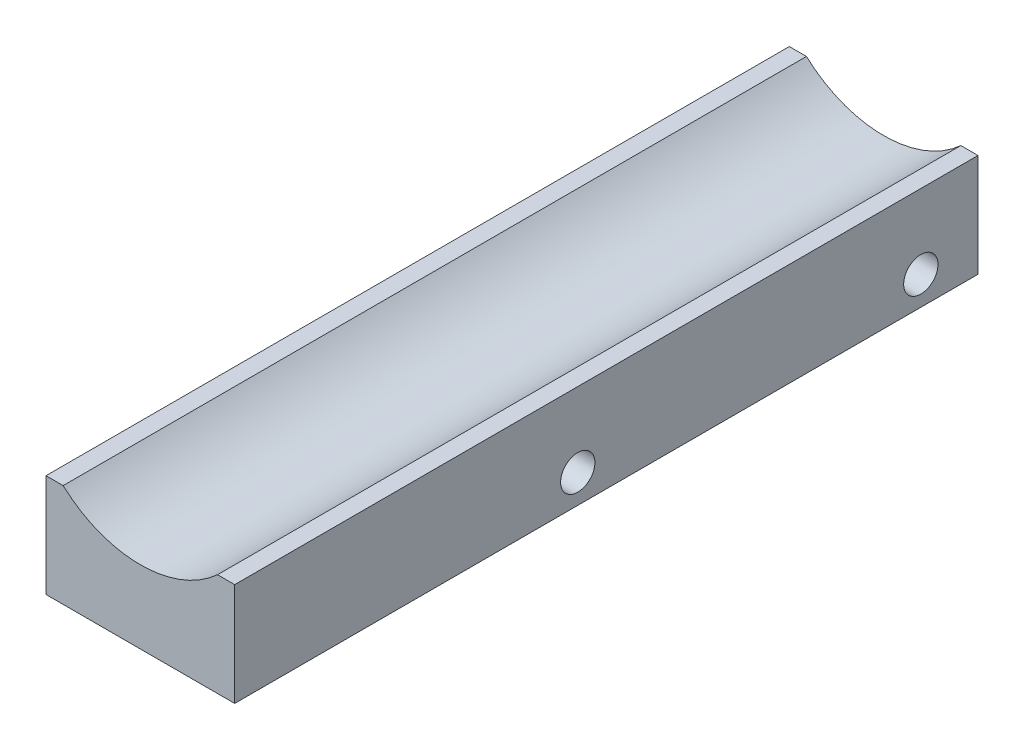
ISO-10303-21;
HEADER;
FILE_DESCRIPTION(('STEP AP214'),'2;1');
FILE_NAME('part.step','',(''),(''),'','','');
FILE_SCHEMA(('AUTOMOTIVE_DESIGN { 1 0 10303 214 1 1 1 1 }'));
ENDSEC;
DATA;
#1=APPLICATION_CONTEXT('core data for automotive mechanical design processes');
#2=APPLICATION_PROTOCOL_DEFINITION('international standard','automotive_design',2000,#1);
#3=PRODUCT_CONTEXT('',#1,'mechanical');
#4=PRODUCT('Part','Part','',(#3));
#5=PRODUCT_RELATED_PRODUCT_CATEGORY('part','',(#4));
#6=PRODUCT_DEFINITION_FORMATION('','',#4);
#7=PRODUCT_DEFINITION_CONTEXT('part definition',#1,'design');
#8=PRODUCT_DEFINITION('design','',#6,#7);
#9=PRODUCT_DEFINITION_SHAPE('','',#8);
#10=(LENGTH_UNIT() NAMED_UNIT(*) SI_UNIT(.MILLI.,.METRE.));
#11=(NAMED_UNIT(*) PLANE_ANGLE_UNIT() SI_UNIT($,.RADIAN.));
#12=(NAMED_UNIT(*) SI_UNIT($,.STERADIAN.) SOLID_ANGLE_UNIT());
#13=UNCERTAINTY_MEASURE_WITH_UNIT(LENGTH_MEASURE(1.E-05),#10,'distance_accuracy_value','');
#14=(GEOMETRIC_REPRESENTATION_CONTEXT(3) GLOBAL_UNCERTAINTY_ASSIGNED_CONTEXT((#13)) GLOBAL_UNIT_ASSIGNED_CONTEXT((#10,
#11,#12)) REPRESENTATION_CONTEXT('',''));
#15=CARTESIAN_POINT('',(0.,0.,0.));
#16=DIRECTION('',(0.,0.,1.));
#17=DIRECTION('',(1.,0.,0.));
#18=AXIS2_PLACEMENT_3D('',#15,#16,#17);
#19=CARTESIAN_POINT('',(-13.5,-5.,60.));
#20=DIRECTION('',(0.,0.,-1.));
#21=DIRECTION('',(1.,0.,0.));
#22=AXIS2_PLACEMENT_3D('',#19,#20,#21);
#23=PLANE('',#22);
#24=DIRECTION('',(-1.,0.,0.));
#25=VECTOR('',#24,1.);
#26=CARTESIAN_POINT('',(13.5,13.,60.));
#27=LINE('',#26,#25);
#28=CARTESIAN_POINT('',(16.5,13.,60.));
#29=VERTEX_POINT('',#28);
#30=CARTESIAN_POINT('',(13.5,13.,60.));
#31=VERTEX_POINT('',#30);
#32=EDGE_CURVE('E49',#29,#31,#27,.T.);
#33=ORIENTED_EDGE('',*,*,#32,.T.);
#34=CARTESIAN_POINT('',(0.,27.7563545633736,60.));
#35=DIRECTION('',(0.,0.,-1.));
#36=DIRECTION('',(1.,0.,0.));
#37=AXIS2_PLACEMENT_3D('',#34,#35,#36);
#38=CIRCLE('',#37,19.9999999999999);
#39=CARTESIAN_POINT('',(-13.5,13.,60.));
#40=VERTEX_POINT('',#39);
#41=EDGE_CURVE('E93',#31,#40,#38,.T.);
#42=ORIENTED_EDGE('',*,*,#41,.T.);
#43=DIRECTION('',(-1.,0.,0.));
#44=VECTOR('',#43,1.);
#45=CARTESIAN_POINT('',(-13.5,13.,60.));
#46=LINE('',#45,#44);
#47=CARTESIAN_POINT('',(-16.5,13.,60.));
#48=VERTEX_POINT('',#47);
#49=EDGE_CURVE('E128',#40,#48,#46,.T.);
#50=ORIENTED_EDGE('',*,*,#49,.T.);
#51=DIRECTION('',(0.,1.,0.));
#52=VECTOR('',#51,1.);
#53=CARTESIAN_POINT('',(-16.5,-5.,60.));
#54=LINE('',#53,#52);
#55=CARTESIAN_POINT('',(-16.5,-5.,60.));
#56=VERTEX_POINT('',#55);
#57=EDGE_CURVE('E130',#56,#48,#54,.T.);
#58=ORIENTED_EDGE('',*,*,#57,.F.);
#59=DIRECTION('',(1.,0.,0.));
#60=VECTOR('',#59,1.);
#61=CARTESIAN_POINT('',(-13.5,-5.,60.));
#62=LINE('',#61,#60);
#63=CARTESIAN_POINT('',(16.5,-5.,60.));
#64=VERTEX_POINT('',#63);
#65=EDGE_CURVE('E11',#56,#64,#62,.T.);
#66=ORIENTED_EDGE('',*,*,#65,.T.);
#67=DIRECTION('',(0.,1.,0.));
#68=VECTOR('',#67,1.);
#69=CARTESIAN_POINT('',(16.5,-5.,60.));
#70=LINE('',#69,#68);
#71=EDGE_CURVE('E135',#64,#29,#70,.T.);
#72=ORIENTED_EDGE('',*,*,#71,.T.);
#73=EDGE_LOOP('',(#33,#42,#50,#58,#66,#72));
#74=FACE_BOUND('',#73,.T.);
#75=ADVANCED_FACE('F41',(#74),#23,.F.);
#76=CARTESIAN_POINT('',(-13.5,-5.,0.));
#77=DIRECTION('',(0.,-1.,0.));
#78=DIRECTION('',(0.,0.,-1.));
#79=AXIS2_PLACEMENT_3D('',#76,#77,#78);
#80=PLANE('',#79);
#81=ORIENTED_EDGE('',*,*,#65,.F.);
#82=DIRECTION('',(0.,0.,1.));
#83=VECTOR('',#82,1.);
#84=CARTESIAN_POINT('',(-16.5,-5.,0.));
#85=LINE('',#84,#83);
#86=CARTESIAN_POINT('',(-16.5,-5.,-70.));
#87=VERTEX_POINT('',#86);
#88=EDGE_CURVE('E129',#56,#87,#85,.F.);
#89=ORIENTED_EDGE('',*,*,#88,.T.);
#90=DIRECTION('',(-1.,0.,0.));
#91=VECTOR('',#90,1.);
#92=CARTESIAN_POINT('',(16.5,-5.,-70.));
#93=LINE('',#92,#91);
#94=CARTESIAN_POINT('',(16.5,-5.,-70.));
#95=VERTEX_POINT('',#94);
#96=EDGE_CURVE('E118',#95,#87,#93,.T.);
#97=ORIENTED_EDGE('',*,*,#96,.F.);
#98=DIRECTION('',(0.,0.,1.));
#99=VECTOR('',#98,1.);
#100=CARTESIAN_POINT('',(16.5,-5.,0.));
#101=LINE('',#100,#99);
#102=EDGE_CURVE('E138',#64,#95,#101,.F.);
#103=ORIENTED_EDGE('',*,*,#102,.F.);
#104=EDGE_LOOP('',(#81,#89,#97,#103));
#105=FACE_BOUND('',#104,.T.);
#106=ADVANCED_FACE('F149',(#105),#80,.T.);
#107=CARTESIAN_POINT('',(13.5,13.,0.));
#108=DIRECTION('',(0.,1.,0.));
#109=DIRECTION('',(0.,0.,-1.));
#110=AXIS2_PLACEMENT_3D('',#107,#108,#109);
#111=PLANE('',#110);
#112=ORIENTED_EDGE('',*,*,#32,.F.);
#113=DIRECTION('',(0.,0.,1.));
#114=VECTOR('',#113,1.);
#115=CARTESIAN_POINT('',(16.5,13.,0.));
#116=LINE('',#115,#114);
#117=CARTESIAN_POINT('',(16.5,13.,-70.));
#118=VERTEX_POINT('',#117);
#119=EDGE_CURVE('E94',#29,#118,#116,.F.);
#120=ORIENTED_EDGE('',*,*,#119,.T.);
#121=DIRECTION('',(1.,0.,0.));
#122=VECTOR('',#121,1.);
#123=CARTESIAN_POINT('',(13.5,13.,-70.));
#124=LINE('',#123,#122);
#125=CARTESIAN_POINT('',(13.5,13.,-70.));
#126=VERTEX_POINT('',#125);
#127=EDGE_CURVE('E97',#126,#118,#124,.T.);
#128=ORIENTED_EDGE('',*,*,#127,.F.);
#129=DIRECTION('',(0.,0.,-1.));
#130=VECTOR('',#129,1.);
#131=CARTESIAN_POINT('',(13.5,13.,0.));
#132=LINE('',#131,#130);
#133=EDGE_CURVE('E87',#31,#126,#132,.T.);
#134=ORIENTED_EDGE('',*,*,#133,.F.);
#135=EDGE_LOOP('',(#112,#120,#128,#134));
#136=FACE_BOUND('',#135,.T.);
#137=ADVANCED_FACE('F98',(#136),#111,.T.);
#138=CARTESIAN_POINT('',(16.5,-5.,0.));
#139=DIRECTION('',(-1.,0.,0.));
#140=DIRECTION('',(0.,0.,1.));
#141=AXIS2_PLACEMENT_3D('',#138,#139,#140);
#142=PLANE('',#141);
#143=CARTESIAN_POINT('',(16.5,0.,0.));
#144=DIRECTION('',(1.,0.,0.));
#145=DIRECTION('',(0.,0.,-1.));
#146=AXIS2_PLACEMENT_3D('',#143,#144,#145);
#147=CIRCLE('',#146,3.);
#148=CARTESIAN_POINT('',(16.5,0.,-3.));
#149=VERTEX_POINT('',#148);
#150=EDGE_CURVE('E254',#149,#149,#147,.T.);
#151=ORIENTED_EDGE('',*,*,#150,.F.);
#152=EDGE_LOOP('',(#151));
#153=FACE_BOUND('',#152,.T.);
#154=CARTESIAN_POINT('',(16.5,-4.16333634234434E-12,-60.0000000000004));
#155=DIRECTION('',(1.,0.,0.));
#156=DIRECTION('',(0.,0.,-1.));
#157=AXIS2_PLACEMENT_3D('',#154,#155,#156);
#158=CIRCLE('',#157,3.);
#159=CARTESIAN_POINT('',(16.5,-4.16333634234434E-12,-63.0000000000004));
#160=VERTEX_POINT('',#159);
#161=EDGE_CURVE('E113',#160,#160,#158,.T.);
#162=ORIENTED_EDGE('',*,*,#161,.F.);
#163=EDGE_LOOP('',(#162));
#164=FACE_BOUND('',#163,.T.);
#165=ORIENTED_EDGE('',*,*,#102,.T.);
#166=DIRECTION('',(0.,-1.,0.));
#167=VECTOR('',#166,1.);
#168=CARTESIAN_POINT('',(16.5,13.,-70.));
#169=LINE('',#168,#167);
#170=EDGE_CURVE('E103',#118,#95,#169,.T.);
#171=ORIENTED_EDGE('',*,*,#170,.F.);
#172=ORIENTED_EDGE('',*,*,#119,.F.);
#173=ORIENTED_EDGE('',*,*,#71,.F.);
#174=EDGE_LOOP('',(#165,#171,#172,#173));
#175=FACE_BOUND('',#174,.T.);
#176=ADVANCED_FACE('F145',(#153,#164,#175),#142,.F.);
#177=CARTESIAN_POINT('',(-13.5,13.,0.));
#178=DIRECTION('',(0.,1.,0.));
#179=DIRECTION('',(0.,0.,-1.));
#180=AXIS2_PLACEMENT_3D('',#177,#178,#179);
#181=PLANE('',#180);
#182=ORIENTED_EDGE('',*,*,#49,.F.);
#183=DIRECTION('',(0.,0.,-1.));
#184=VECTOR('',#183,1.);
#185=CARTESIAN_POINT('',(-13.5,13.,0.));
#186=LINE('',#185,#184);
#187=CARTESIAN_POINT('',(-13.5,13.,-70.));
#188=VERTEX_POINT('',#187);
#189=EDGE_CURVE('E125',#40,#188,#186,.T.);
#190=ORIENTED_EDGE('',*,*,#189,.T.);
#191=DIRECTION('',(1.,0.,0.));
#192=VECTOR('',#191,1.);
#193=CARTESIAN_POINT('',(-16.5,13.,-70.));
#194=LINE('',#193,#192);
#195=CARTESIAN_POINT('',(-16.5,13.,-70.));
#196=VERTEX_POINT('',#195);
#197=EDGE_CURVE('E109',#196,#188,#194,.T.);
#198=ORIENTED_EDGE('',*,*,#197,.F.);
#199=DIRECTION('',(0.,0.,1.));
#200=VECTOR('',#199,1.);
#201=CARTESIAN_POINT('',(-16.5,13.,0.));
#202=LINE('',#201,#200);
#203=EDGE_CURVE('E126',#48,#196,#202,.F.);
#204=ORIENTED_EDGE('',*,*,#203,.F.);
#205=EDGE_LOOP('',(#182,#190,#198,#204));
#206=FACE_BOUND('',#205,.T.);
#207=ADVANCED_FACE('F156',(#206),#181,.T.);
#208=CARTESIAN_POINT('',(-16.5,-5.,0.));
#209=DIRECTION('',(-1.,0.,0.));
#210=DIRECTION('',(0.,0.,1.));
#211=AXIS2_PLACEMENT_3D('',#208,#209,#210);
#212=PLANE('',#211);
#213=CARTESIAN_POINT('',(-16.5,0.,0.));
#214=DIRECTION('',(1.,0.,0.));
#215=DIRECTION('',(0.,0.,-1.));
#216=AXIS2_PLACEMENT_3D('',#213,#214,#215);
#217=CIRCLE('',#216,2.99999999999999);
#218=CARTESIAN_POINT('',(-16.5,0.,-2.99999999999999));
#219=VERTEX_POINT('',#218);
#220=EDGE_CURVE('E251',#219,#219,#217,.T.);
#221=ORIENTED_EDGE('',*,*,#220,.T.);
#222=EDGE_LOOP('',(#221));
#223=FACE_BOUND('',#222,.T.);
#224=CARTESIAN_POINT('',(-16.5,-4.16333634234434E-12,-60.0000000000004));
#225=DIRECTION('',(1.,0.,0.));
#226=DIRECTION('',(0.,0.,-1.));
#227=AXIS2_PLACEMENT_3D('',#224,#225,#226);
#228=CIRCLE('',#227,2.99999999999999);
#229=CARTESIAN_POINT('',(-16.5,-4.16333634234434E-12,-63.0000000000004));
#230=VERTEX_POINT('',#229);
#231=EDGE_CURVE('E110',#230,#230,#228,.T.);
#232=ORIENTED_EDGE('',*,*,#231,.T.);
#233=EDGE_LOOP('',(#232));
#234=FACE_BOUND('',#233,.T.);
#235=ORIENTED_EDGE('',*,*,#203,.T.);
#236=DIRECTION('',(0.,1.,0.));
#237=VECTOR('',#236,1.);
#238=CARTESIAN_POINT('',(-16.5,-5.,-70.));
#239=LINE('',#238,#237);
#240=EDGE_CURVE('E121',#87,#196,#239,.T.);
#241=ORIENTED_EDGE('',*,*,#240,.F.);
#242=ORIENTED_EDGE('',*,*,#88,.F.);
#243=ORIENTED_EDGE('',*,*,#57,.T.);
#244=EDGE_LOOP('',(#235,#241,#242,#243));
#245=FACE_BOUND('',#244,.T.);
#246=ADVANCED_FACE('F152',(#223,#234,#245),#212,.T.);
#247=CARTESIAN_POINT('',(0.,27.7563545633736,-60.));
#248=DIRECTION('',(0.,0.,1.));
#249=DIRECTION('',(1.,0.,0.));
#250=AXIS2_PLACEMENT_3D('',#247,#248,#249);
#251=CYLINDRICAL_SURFACE('',#250,19.9999999999999);
#252=ORIENTED_EDGE('',*,*,#41,.F.);
#253=ORIENTED_EDGE('',*,*,#133,.T.);
#254=CARTESIAN_POINT('',(0.,27.7563545633736,-70.));
#255=DIRECTION('',(0.,0.,1.));
#256=DIRECTION('',(-1.,0.,0.));
#257=AXIS2_PLACEMENT_3D('',#254,#255,#256);
#258=CIRCLE('',#257,19.9999999999999);
#259=EDGE_CURVE('E92',#188,#126,#258,.T.);
#260=ORIENTED_EDGE('',*,*,#259,.F.);
#261=ORIENTED_EDGE('',*,*,#189,.F.);
#262=EDGE_LOOP('',(#252,#253,#260,#261));
#263=FACE_BOUND('',#262,.T.);
#264=ADVANCED_FACE('F89',(#263),#251,.F.);
#265=CARTESIAN_POINT('',(0.,27.7563545633736,-70.));
#266=DIRECTION('',(0.,0.,-1.));
#267=DIRECTION('',(-1.,0.,0.));
#268=AXIS2_PLACEMENT_3D('',#265,#266,#267);
#269=PLANE('',#268);
#270=ORIENTED_EDGE('',*,*,#259,.T.);
#271=ORIENTED_EDGE('',*,*,#127,.T.);
#272=ORIENTED_EDGE('',*,*,#170,.T.);
#273=ORIENTED_EDGE('',*,*,#96,.T.);
#274=ORIENTED_EDGE('',*,*,#240,.T.);
#275=ORIENTED_EDGE('',*,*,#197,.T.);
#276=EDGE_LOOP('',(#270,#271,#272,#273,#274,#275));
#277=FACE_BOUND('',#276,.T.);
#278=ADVANCED_FACE('F106',(#277),#269,.T.);
#279=CARTESIAN_POINT('',(16.5,-4.16333634234434E-12,-60.0000000000004));
#280=DIRECTION('',(1.,0.,0.));
#281=DIRECTION('',(0.,0.,-1.));
#282=AXIS2_PLACEMENT_3D('',#279,#280,#281);
#283=CYLINDRICAL_SURFACE('',#282,2.99999999999999);
#284=ORIENTED_EDGE('',*,*,#231,.F.);
#285=EDGE_LOOP('',(#284));
#286=FACE_BOUND('',#285,.T.);
#287=ORIENTED_EDGE('',*,*,#161,.T.);
#288=EDGE_LOOP('',(#287));
#289=FACE_BOUND('',#288,.T.);
#290=ADVANCED_FACE('F227',(#286,#289),#283,.F.);
#291=CARTESIAN_POINT('',(16.5,0.,0.));
#292=DIRECTION('',(1.,0.,0.));
#293=DIRECTION('',(0.,0.,-1.));
#294=AXIS2_PLACEMENT_3D('',#291,#292,#293);
#295=CYLINDRICAL_SURFACE('',#294,2.99999999999999);
#296=ORIENTED_EDGE('',*,*,#220,.F.);
#297=EDGE_LOOP('',(#296));
#298=FACE_BOUND('',#297,.T.);
#299=ORIENTED_EDGE('',*,*,#150,.T.);
#300=EDGE_LOOP('',(#299));
#301=FACE_BOUND('',#300,.T.);
#302=ADVANCED_FACE('F235',(#298,#301),#295,.F.);
#303=CLOSED_SHELL('',(#75,#106,#137,#176,#207,#246,#264,#278,#290,#302));
#304=MANIFOLD_SOLID_BREP('B2',#303);
#305=ADVANCED_BREP_SHAPE_REPRESENTATION('',(#18,#304),#14);
#306=SHAPE_DEFINITION_REPRESENTATION(#9,#305);
ENDSEC;
END-ISO-10303-21;
